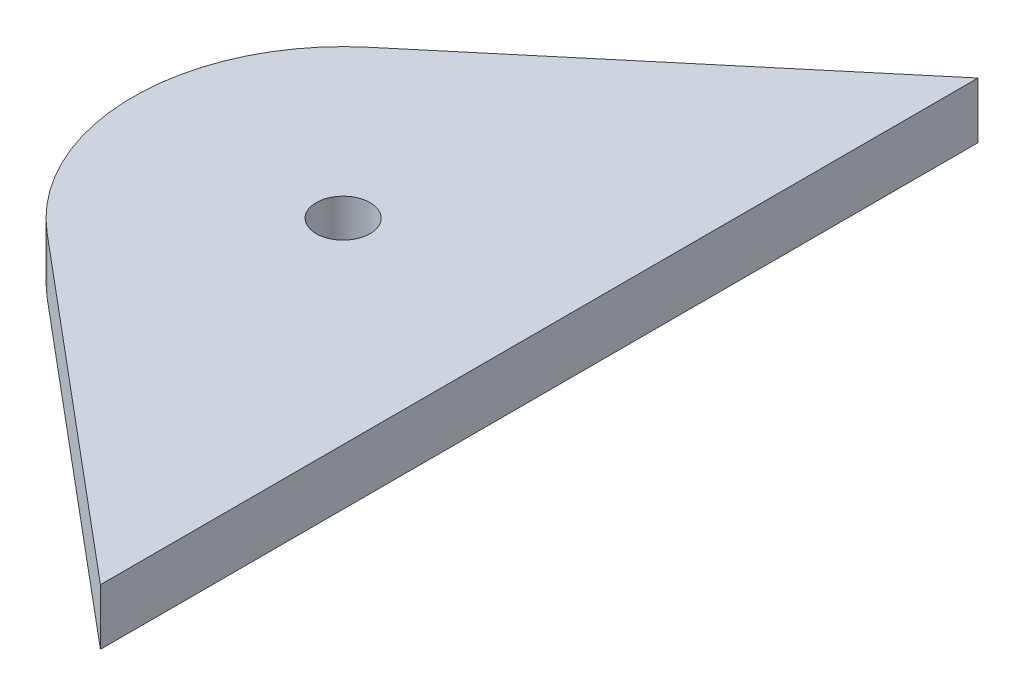
ISO-10303-21;
HEADER;
FILE_DESCRIPTION(('STEP AP214'),'2;1');
FILE_NAME('part.step','',(''),(''),'','','');
FILE_SCHEMA(('AUTOMOTIVE_DESIGN { 1 0 10303 214 1 1 1 1 }'));
ENDSEC;
DATA;
#1=APPLICATION_CONTEXT('core data for automotive mechanical design processes');
#2=APPLICATION_PROTOCOL_DEFINITION('international standard','automotive_design',2000,#1);
#3=PRODUCT_CONTEXT('',#1,'mechanical');
#4=PRODUCT('Part','Part','',(#3));
#5=PRODUCT_RELATED_PRODUCT_CATEGORY('part','',(#4));
#6=PRODUCT_DEFINITION_FORMATION('','',#4);
#7=PRODUCT_DEFINITION_CONTEXT('part definition',#1,'design');
#8=PRODUCT_DEFINITION('design','',#6,#7);
#9=PRODUCT_DEFINITION_SHAPE('','',#8);
#10=(LENGTH_UNIT() NAMED_UNIT(*) SI_UNIT(.MILLI.,.METRE.));
#11=(NAMED_UNIT(*) PLANE_ANGLE_UNIT() SI_UNIT($,.RADIAN.));
#12=(NAMED_UNIT(*) SI_UNIT($,.STERADIAN.) SOLID_ANGLE_UNIT());
#13=UNCERTAINTY_MEASURE_WITH_UNIT(LENGTH_MEASURE(1.E-05),#10,'distance_accuracy_value','');
#14=(GEOMETRIC_REPRESENTATION_CONTEXT(3) GLOBAL_UNCERTAINTY_ASSIGNED_CONTEXT((#13)) GLOBAL_UNIT_ASSIGNED_CONTEXT((#10,
#11,#12)) REPRESENTATION_CONTEXT('',''));
#15=CARTESIAN_POINT('',(0.,0.,0.));
#16=DIRECTION('',(0.,0.,1.));
#17=DIRECTION('',(1.,0.,0.));
#18=AXIS2_PLACEMENT_3D('',#15,#16,#17);
#19=CARTESIAN_POINT('',(-149.691337977009,2.54,-178.395189814333));
#20=DIRECTION('',(0.642787609686545,0.,0.766044443118974));
#21=DIRECTION('',(0.766044443118974,0.,-0.642787609686545));
#22=AXIS2_PLACEMENT_3D('',#19,#20,#21);
#23=PLANE('',#22);
#24=DIRECTION('',(-0.766044443118974,0.,0.642787609686545));
#25=VECTOR('',#24,1.);
#26=CARTESIAN_POINT('',(-149.691337977009,0.,-178.395189814333));
#27=LINE('',#26,#25);
#28=CARTESIAN_POINT('',(-444.533071270542,0.,69.0063998479438));
#29=VERTEX_POINT('',#28);
#30=CARTESIAN_POINT('',(-459.545623252806,0.,81.6034266792917));
#31=VERTEX_POINT('',#30);
#32=EDGE_CURVE('E100',#29,#31,#27,.T.);
#33=ORIENTED_EDGE('',*,*,#32,.T.);
#34=DIRECTION('',(0.,-1.,0.));
#35=VECTOR('',#34,1.);
#36=CARTESIAN_POINT('',(-459.545623252806,2.54,81.6034266792917));
#37=LINE('',#36,#35);
#38=CARTESIAN_POINT('',(-459.545623252806,2.54,81.6034266792917));
#39=VERTEX_POINT('',#38);
#40=EDGE_CURVE('E11',#39,#31,#37,.T.);
#41=ORIENTED_EDGE('',*,*,#40,.F.);
#42=DIRECTION('',(-0.766044443118974,0.,0.642787609686545));
#43=VECTOR('',#42,1.);
#44=CARTESIAN_POINT('',(-149.691337977009,2.54,-178.395189814333));
#45=LINE('',#44,#43);
#46=CARTESIAN_POINT('',(-444.533071270542,2.54,69.0063998479438));
#47=VERTEX_POINT('',#46);
#48=EDGE_CURVE('E85',#47,#39,#45,.T.);
#49=ORIENTED_EDGE('',*,*,#48,.F.);
#50=DIRECTION('',(0.,-1.,0.));
#51=VECTOR('',#50,1.);
#52=CARTESIAN_POINT('',(-444.533071270542,2.54,69.0063998479438));
#53=LINE('',#52,#51);
#54=EDGE_CURVE('E93',#47,#29,#53,.T.);
#55=ORIENTED_EDGE('',*,*,#54,.T.);
#56=EDGE_LOOP('',(#33,#41,#49,#55));
#57=FACE_BOUND('',#56,.T.);
#58=ADVANCED_FACE('F33',(#57),#23,.F.);
#59=CARTESIAN_POINT('',(-453.423071270542,2.54,88.9));
#60=DIRECTION('',(0.,-1.,0.));
#61=DIRECTION('',(0.,0.,-1.));
#62=AXIS2_PLACEMENT_3D('',#59,#60,#61);
#63=CYLINDRICAL_SURFACE('',#62,9.52500000000003);
#64=CARTESIAN_POINT('',(-453.423071270542,0.,88.9));
#65=DIRECTION('',(0.,1.,0.));
#66=DIRECTION('',(0.,0.,1.));
#67=AXIS2_PLACEMENT_3D('',#64,#65,#66);
#68=CIRCLE('',#67,9.52500000000003);
#69=CARTESIAN_POINT('',(-459.545623252806,0.,96.1965733207084));
#70=VERTEX_POINT('',#69);
#71=EDGE_CURVE('E89',#31,#70,#68,.T.);
#72=ORIENTED_EDGE('',*,*,#71,.T.);
#73=DIRECTION('',(0.,-1.,0.));
#74=VECTOR('',#73,1.);
#75=CARTESIAN_POINT('',(-459.545623252806,2.54,96.1965733207084));
#76=LINE('',#75,#74);
#77=CARTESIAN_POINT('',(-459.545623252806,2.54,96.1965733207084));
#78=VERTEX_POINT('',#77);
#79=EDGE_CURVE('E42',#78,#70,#76,.T.);
#80=ORIENTED_EDGE('',*,*,#79,.F.);
#81=CARTESIAN_POINT('',(-453.423071270542,2.54,88.9));
#82=DIRECTION('',(0.,1.,0.));
#83=DIRECTION('',(0.,0.,1.));
#84=AXIS2_PLACEMENT_3D('',#81,#82,#83);
#85=CIRCLE('',#84,9.52500000000003);
#86=EDGE_CURVE('E80',#39,#78,#85,.T.);
#87=ORIENTED_EDGE('',*,*,#86,.F.);
#88=ORIENTED_EDGE('',*,*,#40,.T.);
#89=EDGE_LOOP('',(#72,#80,#87,#88));
#90=FACE_BOUND('',#89,.T.);
#91=ADVANCED_FACE('F88',(#90),#63,.T.);
#92=CARTESIAN_POINT('',(-237.240747219794,2.54,282.732512808922));
#93=DIRECTION('',(0.642787609686543,0.,-0.766044443118975));
#94=DIRECTION('',(-0.766044443118975,0.,-0.642787609686543));
#95=AXIS2_PLACEMENT_3D('',#92,#93,#94);
#96=PLANE('',#95);
#97=DIRECTION('',(0.766044443118975,0.,0.642787609686543));
#98=VECTOR('',#97,1.);
#99=CARTESIAN_POINT('',(-237.240747219794,0.,282.732512808922));
#100=LINE('',#99,#98);
#101=CARTESIAN_POINT('',(-444.533071270542,0.,108.793600152056));
#102=VERTEX_POINT('',#101);
#103=EDGE_CURVE('E67',#70,#102,#100,.T.);
#104=ORIENTED_EDGE('',*,*,#103,.T.);
#105=DIRECTION('',(0.,-1.,0.));
#106=VECTOR('',#105,1.);
#107=CARTESIAN_POINT('',(-444.533071270542,2.54,108.793600152056));
#108=LINE('',#107,#106);
#109=CARTESIAN_POINT('',(-444.533071270542,2.54,108.793600152056));
#110=VERTEX_POINT('',#109);
#111=EDGE_CURVE('E90',#110,#102,#108,.T.);
#112=ORIENTED_EDGE('',*,*,#111,.F.);
#113=DIRECTION('',(0.766044443118975,0.,0.642787609686543));
#114=VECTOR('',#113,1.);
#115=CARTESIAN_POINT('',(-237.240747219794,2.54,282.732512808922));
#116=LINE('',#115,#114);
#117=EDGE_CURVE('E83',#78,#110,#116,.T.);
#118=ORIENTED_EDGE('',*,*,#117,.F.);
#119=ORIENTED_EDGE('',*,*,#79,.T.);
#120=EDGE_LOOP('',(#104,#112,#118,#119));
#121=FACE_BOUND('',#120,.T.);
#122=ADVANCED_FACE('F91',(#121),#96,.F.);
#123=CARTESIAN_POINT('',(-453.423071270542,2.54,88.9));
#124=DIRECTION('',(0.,-1.,0.));
#125=DIRECTION('',(0.,0.,-1.));
#126=AXIS2_PLACEMENT_3D('',#123,#124,#125);
#127=CYLINDRICAL_SURFACE('',#126,1.22148614997857);
#128=CARTESIAN_POINT('',(-453.423071270542,2.54,88.9));
#129=DIRECTION('',(0.,1.,0.));
#130=DIRECTION('',(0.,0.,1.));
#131=AXIS2_PLACEMENT_3D('',#128,#129,#130);
#132=CIRCLE('',#131,1.22148614997857);
#133=CARTESIAN_POINT('',(-453.423071270542,2.54,90.1214861499786));
#134=VERTEX_POINT('',#133);
#135=EDGE_CURVE('E106',#134,#134,#132,.T.);
#136=ORIENTED_EDGE('',*,*,#135,.T.);
#137=EDGE_LOOP('',(#136));
#138=FACE_BOUND('',#137,.T.);
#139=CARTESIAN_POINT('',(-453.423071270542,0.,88.9));
#140=DIRECTION('',(0.,1.,0.));
#141=DIRECTION('',(0.,0.,1.));
#142=AXIS2_PLACEMENT_3D('',#139,#140,#141);
#143=CIRCLE('',#142,1.22148614997857);
#144=CARTESIAN_POINT('',(-453.423071270542,0.,90.1214861499786));
#145=VERTEX_POINT('',#144);
#146=EDGE_CURVE('E97',#145,#145,#143,.T.);
#147=ORIENTED_EDGE('',*,*,#146,.F.);
#148=EDGE_LOOP('',(#147));
#149=FACE_BOUND('',#148,.T.);
#150=ADVANCED_FACE('F35',(#138,#149),#127,.F.);
#151=CARTESIAN_POINT('',(-444.533071270542,2.54,0.));
#152=DIRECTION('',(-1.,0.,0.));
#153=DIRECTION('',(0.,0.,1.));
#154=AXIS2_PLACEMENT_3D('',#151,#152,#153);
#155=PLANE('',#154);
#156=DIRECTION('',(0.,0.,-1.));
#157=VECTOR('',#156,1.);
#158=CARTESIAN_POINT('',(-444.533071270542,0.,0.));
#159=LINE('',#158,#157);
#160=EDGE_CURVE('E73',#102,#29,#159,.T.);
#161=ORIENTED_EDGE('',*,*,#160,.T.);
#162=ORIENTED_EDGE('',*,*,#54,.F.);
#163=DIRECTION('',(0.,0.,-1.));
#164=VECTOR('',#163,1.);
#165=CARTESIAN_POINT('',(-444.533071270542,2.54,0.));
#166=LINE('',#165,#164);
#167=EDGE_CURVE('E50',#110,#47,#166,.T.);
#168=ORIENTED_EDGE('',*,*,#167,.F.);
#169=ORIENTED_EDGE('',*,*,#111,.T.);
#170=EDGE_LOOP('',(#161,#162,#168,#169));
#171=FACE_BOUND('',#170,.T.);
#172=ADVANCED_FACE('F108',(#171),#155,.F.);
#173=CARTESIAN_POINT('',(0.,2.54,0.));
#174=DIRECTION('',(0.,1.,0.));
#175=DIRECTION('',(0.,0.,1.));
#176=AXIS2_PLACEMENT_3D('',#173,#174,#175);
#177=PLANE('',#176);
#178=ORIENTED_EDGE('',*,*,#135,.F.);
#179=EDGE_LOOP('',(#178));
#180=FACE_BOUND('',#179,.T.);
#181=ORIENTED_EDGE('',*,*,#48,.T.);
#182=ORIENTED_EDGE('',*,*,#86,.T.);
#183=ORIENTED_EDGE('',*,*,#117,.T.);
#184=ORIENTED_EDGE('',*,*,#167,.T.);
#185=EDGE_LOOP('',(#181,#182,#183,#184));
#186=FACE_BOUND('',#185,.T.);
#187=ADVANCED_FACE('F81',(#180,#186),#177,.T.);
#188=CARTESIAN_POINT('',(0.,0.,0.));
#189=DIRECTION('',(0.,1.,0.));
#190=DIRECTION('',(0.,0.,1.));
#191=AXIS2_PLACEMENT_3D('',#188,#189,#190);
#192=PLANE('',#191);
#193=ORIENTED_EDGE('',*,*,#146,.T.);
#194=EDGE_LOOP('',(#193));
#195=FACE_BOUND('',#194,.T.);
#196=ORIENTED_EDGE('',*,*,#32,.F.);
#197=ORIENTED_EDGE('',*,*,#160,.F.);
#198=ORIENTED_EDGE('',*,*,#103,.F.);
#199=ORIENTED_EDGE('',*,*,#71,.F.);
#200=EDGE_LOOP('',(#196,#197,#198,#199));
#201=FACE_BOUND('',#200,.T.);
#202=ADVANCED_FACE('F111',(#195,#201),#192,.F.);
#203=CLOSED_SHELL('',(#58,#91,#122,#150,#172,#187,#202));
#204=MANIFOLD_SOLID_BREP('B2',#203);
#205=ADVANCED_BREP_SHAPE_REPRESENTATION('',(#18,#204),#14);
#206=SHAPE_DEFINITION_REPRESENTATION(#9,#205);
ENDSEC;
END-ISO-10303-21;
